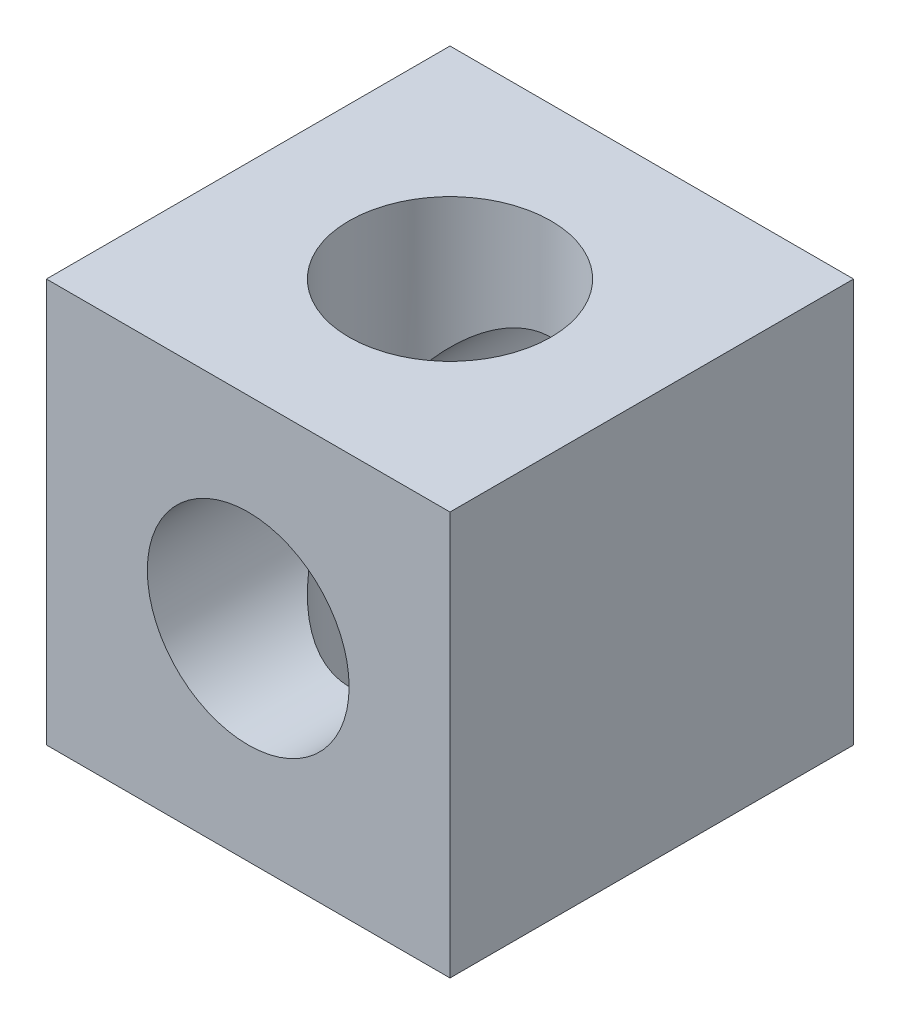
ISO-10303-21;
HEADER;
FILE_DESCRIPTION(('STEP AP214'),'2;1');
FILE_NAME('part.step','',(''),(''),'','','');
FILE_SCHEMA(('AUTOMOTIVE_DESIGN { 1 0 10303 214 1 1 1 1 }'));
ENDSEC;
DATA;
#1=APPLICATION_CONTEXT('core data for automotive mechanical design processes');
#2=APPLICATION_PROTOCOL_DEFINITION('international standard','automotive_design',2000,#1);
#3=PRODUCT_CONTEXT('',#1,'mechanical');
#4=PRODUCT('Part','Part','',(#3));
#5=PRODUCT_RELATED_PRODUCT_CATEGORY('part','',(#4));
#6=PRODUCT_DEFINITION_FORMATION('','',#4);
#7=PRODUCT_DEFINITION_CONTEXT('part definition',#1,'design');
#8=PRODUCT_DEFINITION('design','',#6,#7);
#9=PRODUCT_DEFINITION_SHAPE('','',#8);
#10=(LENGTH_UNIT() NAMED_UNIT(*) SI_UNIT(.MILLI.,.METRE.));
#11=(NAMED_UNIT(*) PLANE_ANGLE_UNIT() SI_UNIT($,.RADIAN.));
#12=(NAMED_UNIT(*) SI_UNIT($,.STERADIAN.) SOLID_ANGLE_UNIT());
#13=UNCERTAINTY_MEASURE_WITH_UNIT(LENGTH_MEASURE(1.E-05),#10,'distance_accuracy_value','');
#14=(GEOMETRIC_REPRESENTATION_CONTEXT(3) GLOBAL_UNCERTAINTY_ASSIGNED_CONTEXT((#13)) GLOBAL_UNIT_ASSIGNED_CONTEXT((#10,
#11,#12)) REPRESENTATION_CONTEXT('',''));
#15=CARTESIAN_POINT('',(0.,0.,0.));
#16=DIRECTION('',(0.,0.,1.));
#17=DIRECTION('',(1.,0.,0.));
#18=AXIS2_PLACEMENT_3D('',#15,#16,#17);
#19=CARTESIAN_POINT('',(-3.1641356201817E-12,-1.49880108324396E-12,9.9999999999999));
#20=DIRECTION('',(0.,0.,-1.));
#21=DIRECTION('',(-1.00000000000002,0.,0.));
#22=AXIS2_PLACEMENT_3D('',#19,#20,#21);
#23=CYLINDRICAL_SURFACE('',#22,2.5);
#24=CARTESIAN_POINT('',(8.32667268468867E-13,-1.66533453693773E-12,5.00000000000012));
#25=DIRECTION('',(0.,0.707106781186559,-0.707106781186543));
#26=DIRECTION('',(0.,-0.707106781186572,-0.70710678118656));
#27=AXIS2_PLACEMENT_3D('',#24,#25,#26);
#28=ELLIPSE('',#27,3.53553390593274,2.5);
#29=CARTESIAN_POINT('',(2.49999999999878,0.,4.99999999999989));
#30=VERTEX_POINT('',#29);
#31=CARTESIAN_POINT('',(-2.50000000000278,8.88178419700125E-13,4.99999999999989));
#32=VERTEX_POINT('',#31);
#33=EDGE_CURVE('E11',#30,#32,#28,.F.);
#34=ORIENTED_EDGE('',*,*,#33,.F.);
#35=CARTESIAN_POINT('',(8.32667268468867E-13,-1.66533453693773E-12,5.00000000000012));
#36=DIRECTION('',(0.,-0.707106781186572,-0.70710678118656));
#37=DIRECTION('',(0.,0.707106781186559,-0.707106781186543));
#38=AXIS2_PLACEMENT_3D('',#35,#36,#37);
#39=ELLIPSE('',#38,3.53553390593274,2.5);
#40=EDGE_CURVE('E30',#32,#30,#39,.F.);
#41=ORIENTED_EDGE('',*,*,#40,.F.);
#42=EDGE_LOOP('',(#34,#41));
#43=FACE_BOUND('',#42,.T.);
#44=CARTESIAN_POINT('',(-3.1641356201817E-12,-1.49880108324396E-12,9.9999999999999));
#45=DIRECTION('',(0.,0.,1.));
#46=DIRECTION('',(1.00000000000002,0.,0.));
#47=AXIS2_PLACEMENT_3D('',#44,#45,#46);
#48=CIRCLE('',#47,2.5);
#49=CARTESIAN_POINT('',(2.4999999999969,-1.52176882206589E-12,9.99999999999988));
#50=VERTEX_POINT('',#49);
#51=EDGE_CURVE('E106',#50,#50,#48,.T.);
#52=ORIENTED_EDGE('',*,*,#51,.T.);
#53=EDGE_LOOP('',(#52));
#54=FACE_BOUND('',#53,.T.);
#55=ADVANCED_FACE('F16',(#43,#54),#23,.F.);
#56=CARTESIAN_POINT('',(-5.,-5.00000000000306,9.99999999999979));
#57=DIRECTION('',(0.,0.,-1.));
#58=DIRECTION('',(-1.00000000000002,0.,0.));
#59=AXIS2_PLACEMENT_3D('',#56,#57,#58);
#60=PLANE('',#59);
#61=DIRECTION('',(0.,-1.00000000000002,0.));
#62=VECTOR('',#61,1.);
#63=CARTESIAN_POINT('',(-5.,-5.00000000000306,9.99999999999979));
#64=LINE('',#63,#62);
#65=CARTESIAN_POINT('',(-5.,5.00000000000106,9.99999999999973));
#66=VERTEX_POINT('',#65);
#67=CARTESIAN_POINT('',(-5.,-5.00000000000306,9.99999999999979));
#68=VERTEX_POINT('',#67);
#69=EDGE_CURVE('E95',#66,#68,#64,.T.);
#70=ORIENTED_EDGE('',*,*,#69,.T.);
#71=DIRECTION('',(1.00000000000002,0.,0.));
#72=VECTOR('',#71,1.);
#73=CARTESIAN_POINT('',(-5.,-5.00000000000306,9.99999999999979));
#74=LINE('',#73,#72);
#75=CARTESIAN_POINT('',(4.99999999999629,-5.00000000000084,10.0000000000002));
#76=VERTEX_POINT('',#75);
#77=EDGE_CURVE('E93',#68,#76,#74,.T.);
#78=ORIENTED_EDGE('',*,*,#77,.T.);
#79=DIRECTION('',(0.,1.00000000000002,0.));
#80=VECTOR('',#79,1.);
#81=CARTESIAN_POINT('',(4.99999999999629,-5.00000000000084,10.0000000000002));
#82=LINE('',#81,#80);
#83=CARTESIAN_POINT('',(4.99999999999923,4.99999999999884,9.99999999999982));
#84=VERTEX_POINT('',#83);
#85=EDGE_CURVE('E91',#76,#84,#82,.T.);
#86=ORIENTED_EDGE('',*,*,#85,.T.);
#87=DIRECTION('',(-1.00000000000002,0.,0.));
#88=VECTOR('',#87,1.);
#89=CARTESIAN_POINT('',(-5.,5.00000000000106,9.99999999999973));
#90=LINE('',#89,#88);
#91=EDGE_CURVE('E38',#84,#66,#90,.T.);
#92=ORIENTED_EDGE('',*,*,#91,.T.);
#93=EDGE_LOOP('',(#70,#78,#86,#92));
#94=FACE_BOUND('',#93,.T.);
#95=ORIENTED_EDGE('',*,*,#51,.F.);
#96=EDGE_LOOP('',(#95));
#97=FACE_BOUND('',#96,.T.);
#98=ADVANCED_FACE('F138',(#94,#97),#60,.F.);
#99=CARTESIAN_POINT('',(-5.00000000000256,-5.00000000000089,-1.94289029309402E-13));
#100=DIRECTION('',(0.,0.,-1.));
#101=DIRECTION('',(-1.00000000000002,0.,0.));
#102=AXIS2_PLACEMENT_3D('',#99,#100,#101);
#103=PLANE('',#102);
#104=DIRECTION('',(0.,-1.00000000000002,0.));
#105=VECTOR('',#104,1.);
#106=CARTESIAN_POINT('',(-5.00000000000256,-5.00000000000089,-1.94289029309402E-13));
#107=LINE('',#106,#105);
#108=CARTESIAN_POINT('',(-4.99999999999962,4.99999999999956,0.));
#109=VERTEX_POINT('',#108);
#110=CARTESIAN_POINT('',(-5.00000000000256,-5.00000000000089,-1.94289029309402E-13));
#111=VERTEX_POINT('',#110);
#112=EDGE_CURVE('E103',#109,#111,#107,.T.);
#113=ORIENTED_EDGE('',*,*,#112,.F.);
#114=DIRECTION('',(-1.00000000000002,0.,0.));
#115=VECTOR('',#114,1.);
#116=CARTESIAN_POINT('',(-4.99999999999962,4.99999999999956,0.));
#117=LINE('',#116,#115);
#118=CARTESIAN_POINT('',(4.99999999999778,5.00000000000028,-3.05311331771918E-13));
#119=VERTEX_POINT('',#118);
#120=EDGE_CURVE('E97',#119,#109,#117,.T.);
#121=ORIENTED_EDGE('',*,*,#120,.F.);
#122=DIRECTION('',(0.,1.00000000000002,0.));
#123=VECTOR('',#122,1.);
#124=CARTESIAN_POINT('',(4.99999999999656,-5.00000000000172,-1.11022302462516E-13));
#125=LINE('',#124,#123);
#126=CARTESIAN_POINT('',(4.99999999999656,-5.00000000000172,-1.11022302462516E-13));
#127=VERTEX_POINT('',#126);
#128=EDGE_CURVE('E99',#127,#119,#125,.T.);
#129=ORIENTED_EDGE('',*,*,#128,.F.);
#130=DIRECTION('',(1.00000000000002,0.,0.));
#131=VECTOR('',#130,1.);
#132=CARTESIAN_POINT('',(-5.00000000000256,-5.00000000000089,-1.94289029309402E-13));
#133=LINE('',#132,#131);
#134=EDGE_CURVE('E101',#111,#127,#133,.T.);
#135=ORIENTED_EDGE('',*,*,#134,.F.);
#136=EDGE_LOOP('',(#113,#121,#129,#135));
#137=FACE_BOUND('',#136,.T.);
#138=CARTESIAN_POINT('',(-1.77635683940025E-12,-1.66533453693773E-13,0.));
#139=DIRECTION('',(0.,0.,1.));
#140=DIRECTION('',(1.00000000000002,0.,0.));
#141=AXIS2_PLACEMENT_3D('',#138,#139,#140);
#142=CIRCLE('',#141,2.5);
#143=CARTESIAN_POINT('',(2.49999999999828,-1.89501192515706E-13,0.));
#144=VERTEX_POINT('',#143);
#145=EDGE_CURVE('E109',#144,#144,#142,.T.);
#146=ORIENTED_EDGE('',*,*,#145,.T.);
#147=EDGE_LOOP('',(#146));
#148=FACE_BOUND('',#147,.T.);
#149=ADVANCED_FACE('F132',(#137,#148),#103,.T.);
#150=CARTESIAN_POINT('',(-5.,-5.00000000000306,9.99999999999979));
#151=DIRECTION('',(1.00000000000002,0.,0.));
#152=DIRECTION('',(0.,0.,-1.));
#153=AXIS2_PLACEMENT_3D('',#150,#151,#152);
#154=PLANE('',#153);
#155=ORIENTED_EDGE('',*,*,#112,.T.);
#156=DIRECTION('',(0.,0.,-1.));
#157=VECTOR('',#156,1.);
#158=CARTESIAN_POINT('',(-5.,-5.00000000000306,9.99999999999979));
#159=LINE('',#158,#157);
#160=EDGE_CURVE('E73',#68,#111,#159,.T.);
#161=ORIENTED_EDGE('',*,*,#160,.F.);
#162=ORIENTED_EDGE('',*,*,#69,.F.);
#163=DIRECTION('',(0.,0.,-1.));
#164=VECTOR('',#163,1.);
#165=CARTESIAN_POINT('',(-5.,5.00000000000106,9.99999999999973));
#166=LINE('',#165,#164);
#167=EDGE_CURVE('E87',#66,#109,#166,.T.);
#168=ORIENTED_EDGE('',*,*,#167,.T.);
#169=EDGE_LOOP('',(#155,#161,#162,#168));
#170=FACE_BOUND('',#169,.T.);
#171=ADVANCED_FACE('F18',(#170),#154,.F.);
#172=CARTESIAN_POINT('',(-5.,-5.00000000000306,9.99999999999979));
#173=DIRECTION('',(0.,1.00000000000002,0.));
#174=DIRECTION('',(0.,0.,1.));
#175=AXIS2_PLACEMENT_3D('',#172,#173,#174);
#176=PLANE('',#175);
#177=CARTESIAN_POINT('',(-1.55431223447522E-12,-5.00000000000006,5.00000000000023));
#178=DIRECTION('',(0.,1.00000000000002,0.));
#179=DIRECTION('',(0.,0.,1.));
#180=AXIS2_PLACEMENT_3D('',#177,#178,#179);
#181=CIRCLE('',#180,2.5);
#182=CARTESIAN_POINT('',(-1.55514490174369E-12,-5.00000000000003,7.50000000000023));
#183=VERTEX_POINT('',#182);
#184=EDGE_CURVE('E112',#183,#183,#181,.T.);
#185=ORIENTED_EDGE('',*,*,#184,.T.);
#186=EDGE_LOOP('',(#185));
#187=FACE_BOUND('',#186,.T.);
#188=ORIENTED_EDGE('',*,*,#134,.T.);
#189=DIRECTION('',(0.,0.,-1.));
#190=VECTOR('',#189,1.);
#191=CARTESIAN_POINT('',(4.99999999999629,-5.00000000000084,10.0000000000002));
#192=LINE('',#191,#190);
#193=EDGE_CURVE('E81',#76,#127,#192,.T.);
#194=ORIENTED_EDGE('',*,*,#193,.F.);
#195=ORIENTED_EDGE('',*,*,#77,.F.);
#196=ORIENTED_EDGE('',*,*,#160,.T.);
#197=EDGE_LOOP('',(#188,#194,#195,#196));
#198=FACE_BOUND('',#197,.T.);
#199=ADVANCED_FACE('F136',(#187,#198),#176,.F.);
#200=CARTESIAN_POINT('',(4.99999999999629,-5.00000000000084,10.0000000000002));
#201=DIRECTION('',(-1.00000000000002,0.,0.));
#202=DIRECTION('',(0.,0.,1.));
#203=AXIS2_PLACEMENT_3D('',#200,#201,#202);
#204=PLANE('',#203);
#205=ORIENTED_EDGE('',*,*,#128,.T.);
#206=DIRECTION('',(0.,0.,-1.));
#207=VECTOR('',#206,1.);
#208=CARTESIAN_POINT('',(4.99999999999923,4.99999999999884,9.99999999999982));
#209=LINE('',#208,#207);
#210=EDGE_CURVE('E84',#84,#119,#209,.T.);
#211=ORIENTED_EDGE('',*,*,#210,.F.);
#212=ORIENTED_EDGE('',*,*,#85,.F.);
#213=ORIENTED_EDGE('',*,*,#193,.T.);
#214=EDGE_LOOP('',(#205,#211,#212,#213));
#215=FACE_BOUND('',#214,.T.);
#216=ADVANCED_FACE('F122',(#215),#204,.F.);
#217=CARTESIAN_POINT('',(-5.,5.00000000000106,9.99999999999973));
#218=DIRECTION('',(0.,-1.00000000000002,0.));
#219=DIRECTION('',(1.00000000000002,0.,0.));
#220=AXIS2_PLACEMENT_3D('',#217,#218,#219);
#221=PLANE('',#220);
#222=CARTESIAN_POINT('',(-7.7715611723761E-13,4.9999999999995,5.00000000000028));
#223=DIRECTION('',(0.,1.00000000000002,0.));
#224=DIRECTION('',(0.,0.,1.));
#225=AXIS2_PLACEMENT_3D('',#222,#223,#224);
#226=CIRCLE('',#225,2.5);
#227=CARTESIAN_POINT('',(-7.77988784506078E-13,4.99999999999953,7.50000000000029));
#228=VERTEX_POINT('',#227);
#229=EDGE_CURVE('E115',#228,#228,#226,.T.);
#230=ORIENTED_EDGE('',*,*,#229,.F.);
#231=EDGE_LOOP('',(#230));
#232=FACE_BOUND('',#231,.T.);
#233=ORIENTED_EDGE('',*,*,#120,.T.);
#234=ORIENTED_EDGE('',*,*,#167,.F.);
#235=ORIENTED_EDGE('',*,*,#91,.F.);
#236=ORIENTED_EDGE('',*,*,#210,.T.);
#237=EDGE_LOOP('',(#233,#234,#235,#236));
#238=FACE_BOUND('',#237,.T.);
#239=ADVANCED_FACE('F119',(#232,#238),#221,.F.);
#240=CARTESIAN_POINT('',(8.32667268468867E-13,-1.66533453693773E-12,5.00000000000012));
#241=DIRECTION('',(0.,0.707106781186559,-0.707106781186543));
#242=DIRECTION('',(0.,-0.707106781186572,-0.70710678118656));
#243=AXIS2_PLACEMENT_3D('',#240,#241,#242);
#244=ELLIPSE('',#243,3.53553390593274,2.5);
#245=EDGE_CURVE('E24',#30,#32,#244,.T.);
#246=ORIENTED_EDGE('',*,*,#245,.F.);
#247=CARTESIAN_POINT('',(8.32667268468867E-13,-1.66533453693773E-12,5.00000000000012));
#248=DIRECTION('',(0.,-0.707106781186572,-0.70710678118656));
#249=DIRECTION('',(0.,0.707106781186559,-0.707106781186543));
#250=AXIS2_PLACEMENT_3D('',#247,#248,#249);
#251=ELLIPSE('',#250,3.53553390593274,2.5);
#252=EDGE_CURVE('E64',#32,#30,#251,.T.);
#253=ORIENTED_EDGE('',*,*,#252,.F.);
#254=EDGE_LOOP('',(#246,#253));
#255=FACE_BOUND('',#254,.T.);
#256=ORIENTED_EDGE('',*,*,#145,.F.);
#257=EDGE_LOOP('',(#256));
#258=FACE_BOUND('',#257,.T.);
#259=ADVANCED_FACE('F76',(#255,#258),#23,.F.);
#260=CARTESIAN_POINT('',(-1.55431223447522E-12,-5.00000000000006,5.00000000000023));
#261=DIRECTION('',(0.,1.00000000000002,0.));
#262=DIRECTION('',(0.,0.,1.));
#263=AXIS2_PLACEMENT_3D('',#260,#261,#262);
#264=CYLINDRICAL_SURFACE('',#263,2.5);
#265=ORIENTED_EDGE('',*,*,#245,.T.);
#266=ORIENTED_EDGE('',*,*,#40,.T.);
#267=EDGE_LOOP('',(#265,#266));
#268=FACE_BOUND('',#267,.T.);
#269=ORIENTED_EDGE('',*,*,#184,.F.);
#270=EDGE_LOOP('',(#269));
#271=FACE_BOUND('',#270,.T.);
#272=ADVANCED_FACE('F71',(#268,#271),#264,.F.);
#273=ORIENTED_EDGE('',*,*,#33,.T.);
#274=ORIENTED_EDGE('',*,*,#252,.T.);
#275=EDGE_LOOP('',(#273,#274));
#276=FACE_BOUND('',#275,.T.);
#277=ORIENTED_EDGE('',*,*,#229,.T.);
#278=EDGE_LOOP('',(#277));
#279=FACE_BOUND('',#278,.T.);
#280=ADVANCED_FACE('F65',(#276,#279),#264,.F.);
#281=CLOSED_SHELL('',(#55,#98,#149,#171,#199,#216,#239,#259,#272,#280));
#282=MANIFOLD_SOLID_BREP('B1',#281);
#283=ADVANCED_BREP_SHAPE_REPRESENTATION('',(#18,#282),#14);
#284=SHAPE_DEFINITION_REPRESENTATION(#9,#283);
ENDSEC;
END-ISO-10303-21;
